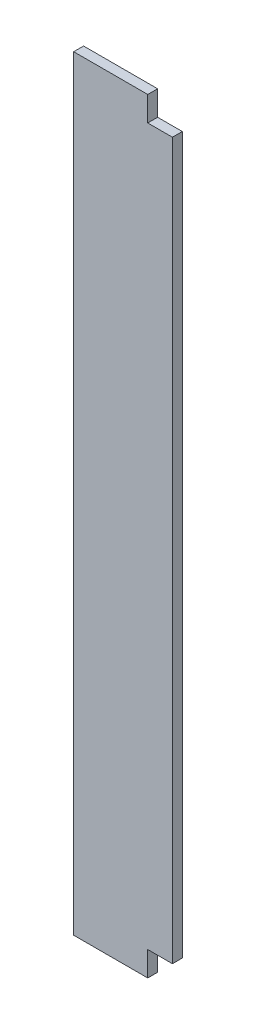
ISO-10303-21;
HEADER;
FILE_DESCRIPTION(('STEP AP214'),'2;1');
FILE_NAME('part.step','',(''),(''),'','','');
FILE_SCHEMA(('AUTOMOTIVE_DESIGN { 1 0 10303 214 1 1 1 1 }'));
ENDSEC;
DATA;
#1=APPLICATION_CONTEXT('core data for automotive mechanical design processes');
#2=APPLICATION_PROTOCOL_DEFINITION('international standard','automotive_design',2000,#1);
#3=PRODUCT_CONTEXT('',#1,'mechanical');
#4=PRODUCT('Part','Part','',(#3));
#5=PRODUCT_RELATED_PRODUCT_CATEGORY('part','',(#4));
#6=PRODUCT_DEFINITION_FORMATION('','',#4);
#7=PRODUCT_DEFINITION_CONTEXT('part definition',#1,'design');
#8=PRODUCT_DEFINITION('design','',#6,#7);
#9=PRODUCT_DEFINITION_SHAPE('','',#8);
#10=(LENGTH_UNIT() NAMED_UNIT(*) SI_UNIT(.MILLI.,.METRE.));
#11=(NAMED_UNIT(*) PLANE_ANGLE_UNIT() SI_UNIT($,.RADIAN.));
#12=(NAMED_UNIT(*) SI_UNIT($,.STERADIAN.) SOLID_ANGLE_UNIT());
#13=UNCERTAINTY_MEASURE_WITH_UNIT(LENGTH_MEASURE(1.E-05),#10,'distance_accuracy_value','');
#14=(GEOMETRIC_REPRESENTATION_CONTEXT(3) GLOBAL_UNCERTAINTY_ASSIGNED_CONTEXT((#13)) GLOBAL_UNIT_ASSIGNED_CONTEXT((#10,
#11,#12)) REPRESENTATION_CONTEXT('',''));
#15=CARTESIAN_POINT('',(0.,0.,0.));
#16=DIRECTION('',(0.,0.,1.));
#17=DIRECTION('',(1.,0.,0.));
#18=AXIS2_PLACEMENT_3D('',#15,#16,#17);
#19=CARTESIAN_POINT('',(-129.608938547486,1550.,-67.4581005586592));
#20=DIRECTION('',(1.,0.,0.));
#21=DIRECTION('',(0.,0.,-1.));
#22=AXIS2_PLACEMENT_3D('',#19,#20,#21);
#23=PLANE('',#22);
#24=DIRECTION('',(0.,0.,1.));
#25=VECTOR('',#24,1.);
#26=CARTESIAN_POINT('',(-129.608938547486,0.,-67.4581005586592));
#27=LINE('',#26,#25);
#28=CARTESIAN_POINT('',(-129.608938547486,0.,-67.4581005586592));
#29=VERTEX_POINT('',#28);
#30=CARTESIAN_POINT('',(-129.608938547486,0.,-47.4581005586592));
#31=VERTEX_POINT('',#30);
#32=EDGE_CURVE('E136',#29,#31,#27,.T.);
#33=ORIENTED_EDGE('',*,*,#32,.T.);
#34=DIRECTION('',(0.,-1.,0.));
#35=VECTOR('',#34,1.);
#36=CARTESIAN_POINT('',(-129.608938547486,1550.,-47.4581005586592));
#37=LINE('',#36,#35);
#38=CARTESIAN_POINT('',(-129.608938547486,1550.,-47.4581005586592));
#39=VERTEX_POINT('',#38);
#40=EDGE_CURVE('E11',#39,#31,#37,.T.);
#41=ORIENTED_EDGE('',*,*,#40,.F.);
#42=DIRECTION('',(0.,0.,1.));
#43=VECTOR('',#42,1.);
#44=CARTESIAN_POINT('',(-129.608938547486,1550.,-67.4581005586592));
#45=LINE('',#44,#43);
#46=CARTESIAN_POINT('',(-129.608938547486,1550.,-67.4581005586592));
#47=VERTEX_POINT('',#46);
#48=EDGE_CURVE('E141',#47,#39,#45,.T.);
#49=ORIENTED_EDGE('',*,*,#48,.F.);
#50=DIRECTION('',(0.,-1.,0.));
#51=VECTOR('',#50,1.);
#52=CARTESIAN_POINT('',(-129.608938547486,1550.,-67.4581005586592));
#53=LINE('',#52,#51);
#54=EDGE_CURVE('E149',#47,#29,#53,.T.);
#55=ORIENTED_EDGE('',*,*,#54,.T.);
#56=EDGE_LOOP('',(#33,#41,#49,#55));
#57=FACE_BOUND('',#56,.T.);
#58=ADVANCED_FACE('F33',(#57),#23,.F.);
#59=CARTESIAN_POINT('',(-129.608938547486,1550.,-47.4581005586592));
#60=DIRECTION('',(0.,0.,-1.));
#61=DIRECTION('',(-1.,0.,0.));
#62=AXIS2_PLACEMENT_3D('',#59,#60,#61);
#63=PLANE('',#62);
#64=DIRECTION('',(0.,-1.,0.));
#65=VECTOR('',#64,1.);
#66=CARTESIAN_POINT('',(70.3910614525139,1550.,-47.4581005586592));
#67=LINE('',#66,#65);
#68=CARTESIAN_POINT('',(70.3910614525139,1500.,-47.4581005586592));
#69=VERTEX_POINT('',#68);
#70=CARTESIAN_POINT('',(70.3910614525139,50.,-47.4581005586592));
#71=VERTEX_POINT('',#70);
#72=EDGE_CURVE('E40',#69,#71,#67,.T.);
#73=ORIENTED_EDGE('',*,*,#72,.F.);
#74=DIRECTION('',(1.,0.,0.));
#75=VECTOR('',#74,1.);
#76=CARTESIAN_POINT('',(70.3910614525139,1500.,-47.4581005586592));
#77=LINE('',#76,#75);
#78=CARTESIAN_POINT('',(20.3910614525139,1500.,-47.4581005586592));
#79=VERTEX_POINT('',#78);
#80=EDGE_CURVE('E116',#79,#69,#77,.T.);
#81=ORIENTED_EDGE('',*,*,#80,.F.);
#82=DIRECTION('',(0.,-1.,0.));
#83=VECTOR('',#82,1.);
#84=CARTESIAN_POINT('',(20.3910614525139,1550.,-47.4581005586592));
#85=LINE('',#84,#83);
#86=CARTESIAN_POINT('',(20.3910614525139,1550.,-47.4581005586592));
#87=VERTEX_POINT('',#86);
#88=EDGE_CURVE('E99',#87,#79,#85,.T.);
#89=ORIENTED_EDGE('',*,*,#88,.F.);
#90=DIRECTION('',(1.,0.,0.));
#91=VECTOR('',#90,1.);
#92=CARTESIAN_POINT('',(-129.608938547486,1550.,-47.4581005586592));
#93=LINE('',#92,#91);
#94=EDGE_CURVE('E144',#39,#87,#93,.T.);
#95=ORIENTED_EDGE('',*,*,#94,.F.);
#96=ORIENTED_EDGE('',*,*,#40,.T.);
#97=DIRECTION('',(1.,0.,0.));
#98=VECTOR('',#97,1.);
#99=CARTESIAN_POINT('',(-129.608938547486,0.,-47.4581005586592));
#100=LINE('',#99,#98);
#101=CARTESIAN_POINT('',(20.3910614525139,0.,-47.4581005586592));
#102=VERTEX_POINT('',#101);
#103=EDGE_CURVE('E152',#31,#102,#100,.T.);
#104=ORIENTED_EDGE('',*,*,#103,.T.);
#105=DIRECTION('',(0.,-1.,0.));
#106=VECTOR('',#105,1.);
#107=CARTESIAN_POINT('',(20.3910614525139,0.,-47.4581005586592));
#108=LINE('',#107,#106);
#109=CARTESIAN_POINT('',(20.3910614525139,50.,-47.4581005586592));
#110=VERTEX_POINT('',#109);
#111=EDGE_CURVE('E55',#110,#102,#108,.T.);
#112=ORIENTED_EDGE('',*,*,#111,.F.);
#113=DIRECTION('',(-1.,0.,0.));
#114=VECTOR('',#113,1.);
#115=CARTESIAN_POINT('',(70.3910614525139,50.,-47.4581005586592));
#116=LINE('',#115,#114);
#117=EDGE_CURVE('E121',#71,#110,#116,.T.);
#118=ORIENTED_EDGE('',*,*,#117,.F.);
#119=EDGE_LOOP('',(#73,#81,#89,#95,#96,#104,#112,#118));
#120=FACE_BOUND('',#119,.T.);
#121=ADVANCED_FACE('F168',(#120),#63,.F.);
#122=CARTESIAN_POINT('',(70.3910614525139,1550.,-67.4581005586592));
#123=DIRECTION('',(-1.,0.,0.));
#124=DIRECTION('',(0.,0.,1.));
#125=AXIS2_PLACEMENT_3D('',#122,#123,#124);
#126=PLANE('',#125);
#127=DIRECTION('',(0.,-1.,0.));
#128=VECTOR('',#127,1.);
#129=CARTESIAN_POINT('',(70.3910614525139,1550.,-67.4581005586592));
#130=LINE('',#129,#128);
#131=CARTESIAN_POINT('',(70.3910614525139,1500.,-67.4581005586592));
#132=VERTEX_POINT('',#131);
#133=CARTESIAN_POINT('',(70.3910614525139,50.,-67.4581005586592));
#134=VERTEX_POINT('',#133);
#135=EDGE_CURVE('E158',#132,#134,#130,.T.);
#136=ORIENTED_EDGE('',*,*,#135,.F.);
#137=DIRECTION('',(0.,0.,1.));
#138=VECTOR('',#137,1.);
#139=CARTESIAN_POINT('',(70.3910614525139,1500.,-67.4581005586592));
#140=LINE('',#139,#138);
#141=EDGE_CURVE('E102',#132,#69,#140,.T.);
#142=ORIENTED_EDGE('',*,*,#141,.T.);
#143=ORIENTED_EDGE('',*,*,#72,.T.);
#144=DIRECTION('',(0.,0.,1.));
#145=VECTOR('',#144,1.);
#146=CARTESIAN_POINT('',(70.3910614525139,50.,-67.4581005586592));
#147=LINE('',#146,#145);
#148=EDGE_CURVE('E130',#134,#71,#147,.T.);
#149=ORIENTED_EDGE('',*,*,#148,.F.);
#150=EDGE_LOOP('',(#136,#142,#143,#149));
#151=FACE_BOUND('',#150,.T.);
#152=ADVANCED_FACE('F162',(#151),#126,.F.);
#153=CARTESIAN_POINT('',(-129.608938547486,1550.,-67.4581005586592));
#154=DIRECTION('',(0.,0.,1.));
#155=DIRECTION('',(1.,0.,0.));
#156=AXIS2_PLACEMENT_3D('',#153,#154,#155);
#157=PLANE('',#156);
#158=DIRECTION('',(0.,-1.,0.));
#159=VECTOR('',#158,1.);
#160=CARTESIAN_POINT('',(20.3910614525139,1550.,-67.4581005586592));
#161=LINE('',#160,#159);
#162=CARTESIAN_POINT('',(20.3910614525139,1550.,-67.4581005586592));
#163=VERTEX_POINT('',#162);
#164=CARTESIAN_POINT('',(20.3910614525139,1500.,-67.4581005586592));
#165=VERTEX_POINT('',#164);
#166=EDGE_CURVE('E47',#163,#165,#161,.T.);
#167=ORIENTED_EDGE('',*,*,#166,.T.);
#168=DIRECTION('',(1.,0.,0.));
#169=VECTOR('',#168,1.);
#170=CARTESIAN_POINT('',(70.3910614525139,1500.,-67.4581005586592));
#171=LINE('',#170,#169);
#172=EDGE_CURVE('E106',#165,#132,#171,.T.);
#173=ORIENTED_EDGE('',*,*,#172,.T.);
#174=ORIENTED_EDGE('',*,*,#135,.T.);
#175=DIRECTION('',(-1.,0.,0.));
#176=VECTOR('',#175,1.);
#177=CARTESIAN_POINT('',(70.3910614525139,50.,-67.4581005586592));
#178=LINE('',#177,#176);
#179=CARTESIAN_POINT('',(20.3910614525139,50.,-67.4581005586592));
#180=VERTEX_POINT('',#179);
#181=EDGE_CURVE('E124',#134,#180,#178,.T.);
#182=ORIENTED_EDGE('',*,*,#181,.T.);
#183=DIRECTION('',(0.,-1.,0.));
#184=VECTOR('',#183,1.);
#185=CARTESIAN_POINT('',(20.3910614525139,0.,-67.4581005586592));
#186=LINE('',#185,#184);
#187=CARTESIAN_POINT('',(20.3910614525139,0.,-67.4581005586592));
#188=VERTEX_POINT('',#187);
#189=EDGE_CURVE('E127',#180,#188,#186,.T.);
#190=ORIENTED_EDGE('',*,*,#189,.T.);
#191=DIRECTION('',(-1.,0.,0.));
#192=VECTOR('',#191,1.);
#193=CARTESIAN_POINT('',(-129.608938547486,0.,-67.4581005586592));
#194=LINE('',#193,#192);
#195=EDGE_CURVE('E145',#188,#29,#194,.T.);
#196=ORIENTED_EDGE('',*,*,#195,.T.);
#197=ORIENTED_EDGE('',*,*,#54,.F.);
#198=DIRECTION('',(-1.,0.,0.));
#199=VECTOR('',#198,1.);
#200=CARTESIAN_POINT('',(-129.608938547486,1550.,-67.4581005586592));
#201=LINE('',#200,#199);
#202=EDGE_CURVE('E115',#163,#47,#201,.T.);
#203=ORIENTED_EDGE('',*,*,#202,.F.);
#204=EDGE_LOOP('',(#167,#173,#174,#182,#190,#196,#197,#203));
#205=FACE_BOUND('',#204,.T.);
#206=ADVANCED_FACE('F113',(#205),#157,.F.);
#207=CARTESIAN_POINT('',(0.,1550.,0.));
#208=DIRECTION('',(0.,1.,0.));
#209=DIRECTION('',(0.,0.,1.));
#210=AXIS2_PLACEMENT_3D('',#207,#208,#209);
#211=PLANE('',#210);
#212=DIRECTION('',(0.,0.,1.));
#213=VECTOR('',#212,1.);
#214=CARTESIAN_POINT('',(20.3910614525139,1550.,-67.4581005586592));
#215=LINE('',#214,#213);
#216=EDGE_CURVE('E103',#163,#87,#215,.T.);
#217=ORIENTED_EDGE('',*,*,#216,.F.);
#218=ORIENTED_EDGE('',*,*,#202,.T.);
#219=ORIENTED_EDGE('',*,*,#48,.T.);
#220=ORIENTED_EDGE('',*,*,#94,.T.);
#221=EDGE_LOOP('',(#217,#218,#219,#220));
#222=FACE_BOUND('',#221,.T.);
#223=ADVANCED_FACE('F179',(#222),#211,.T.);
#224=CARTESIAN_POINT('',(0.,0.,0.));
#225=DIRECTION('',(0.,1.,0.));
#226=DIRECTION('',(0.,0.,1.));
#227=AXIS2_PLACEMENT_3D('',#224,#225,#226);
#228=PLANE('',#227);
#229=ORIENTED_EDGE('',*,*,#195,.F.);
#230=DIRECTION('',(0.,0.,1.));
#231=VECTOR('',#230,1.);
#232=CARTESIAN_POINT('',(20.3910614525139,0.,-67.4581005586592));
#233=LINE('',#232,#231);
#234=EDGE_CURVE('E134',#188,#102,#233,.T.);
#235=ORIENTED_EDGE('',*,*,#234,.T.);
#236=ORIENTED_EDGE('',*,*,#103,.F.);
#237=ORIENTED_EDGE('',*,*,#32,.F.);
#238=EDGE_LOOP('',(#229,#235,#236,#237));
#239=FACE_BOUND('',#238,.T.);
#240=ADVANCED_FACE('F173',(#239),#228,.F.);
#241=CARTESIAN_POINT('',(20.3910614525139,0.,-67.4581005586592));
#242=DIRECTION('',(-1.,0.,0.));
#243=DIRECTION('',(0.,0.,1.));
#244=AXIS2_PLACEMENT_3D('',#241,#242,#243);
#245=PLANE('',#244);
#246=ORIENTED_EDGE('',*,*,#111,.T.);
#247=ORIENTED_EDGE('',*,*,#234,.F.);
#248=ORIENTED_EDGE('',*,*,#189,.F.);
#249=DIRECTION('',(0.,0.,1.));
#250=VECTOR('',#249,1.);
#251=CARTESIAN_POINT('',(20.3910614525139,50.,-67.4581005586592));
#252=LINE('',#251,#250);
#253=EDGE_CURVE('E137',#180,#110,#252,.T.);
#254=ORIENTED_EDGE('',*,*,#253,.T.);
#255=EDGE_LOOP('',(#246,#247,#248,#254));
#256=FACE_BOUND('',#255,.T.);
#257=ADVANCED_FACE('F175',(#256),#245,.F.);
#258=CARTESIAN_POINT('',(70.3910614525139,50.,-67.4581005586592));
#259=DIRECTION('',(0.,1.,0.));
#260=DIRECTION('',(-1.,0.,0.));
#261=AXIS2_PLACEMENT_3D('',#258,#259,#260);
#262=PLANE('',#261);
#263=ORIENTED_EDGE('',*,*,#117,.T.);
#264=ORIENTED_EDGE('',*,*,#253,.F.);
#265=ORIENTED_EDGE('',*,*,#181,.F.);
#266=ORIENTED_EDGE('',*,*,#148,.T.);
#267=EDGE_LOOP('',(#263,#264,#265,#266));
#268=FACE_BOUND('',#267,.T.);
#269=ADVANCED_FACE('F167',(#268),#262,.F.);
#270=CARTESIAN_POINT('',(70.3910614525139,1500.,-67.4581005586592));
#271=DIRECTION('',(0.,-1.,0.));
#272=DIRECTION('',(0.,0.,-1.));
#273=AXIS2_PLACEMENT_3D('',#270,#271,#272);
#274=PLANE('',#273);
#275=ORIENTED_EDGE('',*,*,#80,.T.);
#276=ORIENTED_EDGE('',*,*,#141,.F.);
#277=ORIENTED_EDGE('',*,*,#172,.F.);
#278=DIRECTION('',(0.,0.,1.));
#279=VECTOR('',#278,1.);
#280=CARTESIAN_POINT('',(20.3910614525139,1500.,-67.4581005586592));
#281=LINE('',#280,#279);
#282=EDGE_CURVE('E95',#165,#79,#281,.T.);
#283=ORIENTED_EDGE('',*,*,#282,.T.);
#284=EDGE_LOOP('',(#275,#276,#277,#283));
#285=FACE_BOUND('',#284,.T.);
#286=ADVANCED_FACE('F107',(#285),#274,.F.);
#287=CARTESIAN_POINT('',(20.3910614525139,1550.,-67.4581005586592));
#288=DIRECTION('',(-1.,0.,0.));
#289=DIRECTION('',(0.,-1.,0.));
#290=AXIS2_PLACEMENT_3D('',#287,#288,#289);
#291=PLANE('',#290);
#292=ORIENTED_EDGE('',*,*,#88,.T.);
#293=ORIENTED_EDGE('',*,*,#282,.F.);
#294=ORIENTED_EDGE('',*,*,#166,.F.);
#295=ORIENTED_EDGE('',*,*,#216,.T.);
#296=EDGE_LOOP('',(#292,#293,#294,#295));
#297=FACE_BOUND('',#296,.T.);
#298=ADVANCED_FACE('F97',(#297),#291,.F.);
#299=CLOSED_SHELL('',(#58,#121,#152,#206,#223,#240,#257,#269,#286,#298));
#300=MANIFOLD_SOLID_BREP('B2',#299);
#301=ADVANCED_BREP_SHAPE_REPRESENTATION('',(#18,#300),#14);
#302=SHAPE_DEFINITION_REPRESENTATION(#9,#301);
ENDSEC;
END-ISO-10303-21;
